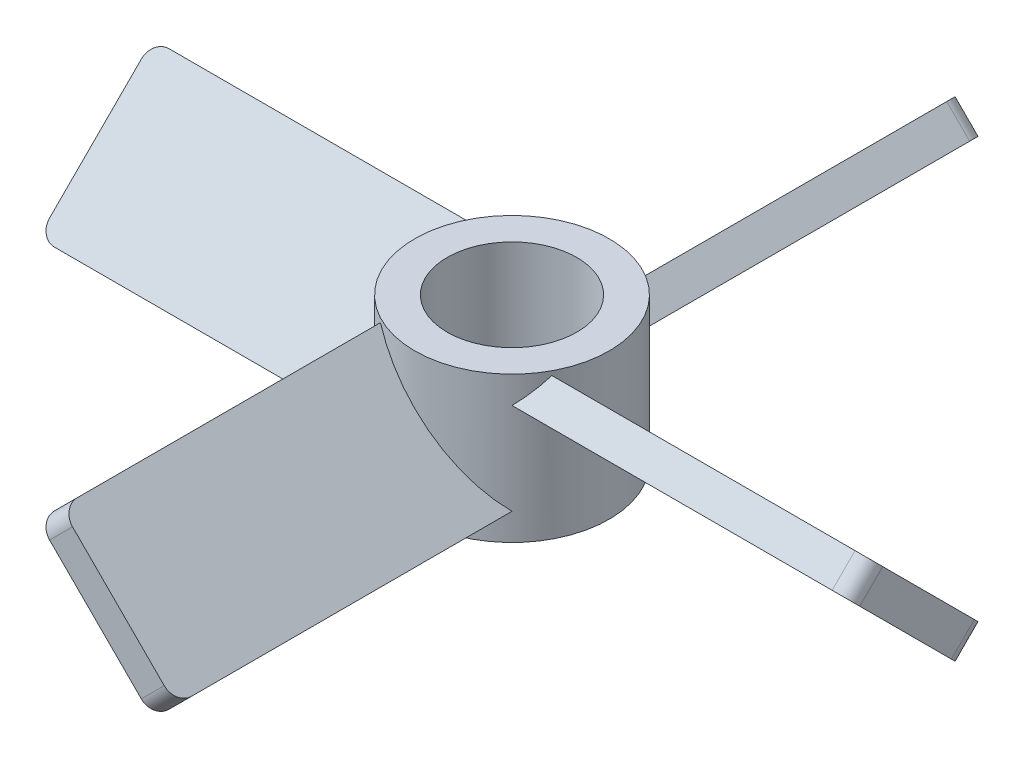
ISO-10303-21;
HEADER;
FILE_DESCRIPTION(('STEP AP214'),'2;1');
FILE_NAME('part.step','',(''),(''),'','','');
FILE_SCHEMA(('AUTOMOTIVE_DESIGN { 1 0 10303 214 1 1 1 1 }'));
ENDSEC;
DATA;
#1=APPLICATION_CONTEXT('core data for automotive mechanical design processes');
#2=APPLICATION_PROTOCOL_DEFINITION('international standard','automotive_design',2000,#1);
#3=PRODUCT_CONTEXT('',#1,'mechanical');
#4=PRODUCT('Part','Part','',(#3));
#5=PRODUCT_RELATED_PRODUCT_CATEGORY('part','',(#4));
#6=PRODUCT_DEFINITION_FORMATION('','',#4);
#7=PRODUCT_DEFINITION_CONTEXT('part definition',#1,'design');
#8=PRODUCT_DEFINITION('design','',#6,#7);
#9=PRODUCT_DEFINITION_SHAPE('','',#8);
#10=(LENGTH_UNIT() NAMED_UNIT(*) SI_UNIT(.MILLI.,.METRE.));
#11=(NAMED_UNIT(*) PLANE_ANGLE_UNIT() SI_UNIT($,.RADIAN.));
#12=(NAMED_UNIT(*) SI_UNIT($,.STERADIAN.) SOLID_ANGLE_UNIT());
#13=UNCERTAINTY_MEASURE_WITH_UNIT(LENGTH_MEASURE(1.E-05),#10,'distance_accuracy_value','');
#14=(GEOMETRIC_REPRESENTATION_CONTEXT(3) GLOBAL_UNCERTAINTY_ASSIGNED_CONTEXT((#13)) GLOBAL_UNIT_ASSIGNED_CONTEXT((#10,
#11,#12)) REPRESENTATION_CONTEXT('',''));
#15=CARTESIAN_POINT('',(0.,0.,0.));
#16=DIRECTION('',(0.,0.,1.));
#17=DIRECTION('',(1.,0.,0.));
#18=AXIS2_PLACEMENT_3D('',#15,#16,#17);
#19=CARTESIAN_POINT('',(-4.,4.5,0.));
#20=DIRECTION('',(0.,-1.,0.));
#21=DIRECTION('',(0.,0.,-1.));
#22=AXIS2_PLACEMENT_3D('',#19,#20,#21);
#23=CYLINDRICAL_SURFACE('',#22,6.);
#24=CARTESIAN_POINT('',(-4.,-7.07106781186544,0.));
#25=DIRECTION('',(0.,0.707106781186549,-0.707106781186546));
#26=DIRECTION('',(0.,-0.707106781186546,-0.707106781186549));
#27=AXIS2_PLACEMENT_3D('',#24,#25,#26);
#28=ELLIPSE('',#27,8.48528137423856,6.);
#29=CARTESIAN_POINT('',(-8.24264068711935,-2.82842712474624,4.24264068711922));
#30=VERTEX_POINT('',#29);
#31=CARTESIAN_POINT('',(-9.29150262212917,-4.24264068711925,2.82842712474624));
#32=VERTEX_POINT('',#31);
#33=EDGE_CURVE('E575',#30,#32,#28,.F.);
#34=ORIENTED_EDGE('',*,*,#33,.T.);
#35=CARTESIAN_POINT('',(-4.,-1.41421356237297,0.));
#36=DIRECTION('',(0.,0.707106781186546,0.707106781186549));
#37=DIRECTION('',(0.,-0.707106781186549,0.707106781186546));
#38=AXIS2_PLACEMENT_3D('',#35,#36,#37);
#39=ELLIPSE('',#38,8.48528137423859,6.);
#40=CARTESIAN_POINT('',(-8.24264068711932,2.82842712474627,-4.24264068711925));
#41=VERTEX_POINT('',#40);
#42=EDGE_CURVE('E214',#32,#41,#39,.F.);
#43=ORIENTED_EDGE('',*,*,#42,.T.);
#44=CARTESIAN_POINT('',(-4.,7.07106781186544,0.));
#45=DIRECTION('',(0.,-0.707106781186549,0.707106781186546));
#46=DIRECTION('',(0.,-0.707106781186546,-0.707106781186549));
#47=AXIS2_PLACEMENT_3D('',#44,#45,#46);
#48=ELLIPSE('',#47,8.48528137423856,6.);
#49=CARTESIAN_POINT('',(-9.29150262212917,4.24264068711923,-2.82842712474622));
#50=VERTEX_POINT('',#49);
#51=EDGE_CURVE('E773',#41,#50,#48,.F.);
#52=ORIENTED_EDGE('',*,*,#51,.T.);
#53=CARTESIAN_POINT('',(-4.,1.41421356237298,0.));
#54=DIRECTION('',(0.,-0.707106781186546,-0.707106781186549));
#55=DIRECTION('',(0.,-0.707106781186549,0.707106781186546));
#56=AXIS2_PLACEMENT_3D('',#53,#54,#55);
#57=ELLIPSE('',#56,8.48528137423859,6.);
#58=EDGE_CURVE('E780',#50,#30,#57,.F.);
#59=ORIENTED_EDGE('',*,*,#58,.T.);
#60=EDGE_LOOP('',(#34,#43,#52,#59));
#61=FACE_BOUND('',#60,.T.);
#62=CARTESIAN_POINT('',(-4.,-7.07106781186544,0.));
#63=DIRECTION('',(0.,0.707106781186549,0.707106781186546));
#64=DIRECTION('',(0.,-0.707106781186546,0.707106781186549));
#65=AXIS2_PLACEMENT_3D('',#62,#63,#64);
#66=ELLIPSE('',#65,8.48528137423856,6.);
#67=CARTESIAN_POINT('',(0.242640687119353,-2.82842712474614,-4.24264068711932));
#68=VERTEX_POINT('',#67);
#69=CARTESIAN_POINT('',(1.29150262212917,-4.24264068711925,-2.82842712474624));
#70=VERTEX_POINT('',#69);
#71=EDGE_CURVE('E480',#68,#70,#66,.F.);
#72=ORIENTED_EDGE('',*,*,#71,.T.);
#73=CARTESIAN_POINT('',(-4.,-1.41421356237297,0.));
#74=DIRECTION('',(0.,0.707106781186546,-0.707106781186549));
#75=DIRECTION('',(0.,-0.707106781186549,-0.707106781186546));
#76=AXIS2_PLACEMENT_3D('',#73,#74,#75);
#77=ELLIPSE('',#76,8.48528137423859,6.);
#78=CARTESIAN_POINT('',(0.242640687119252,2.82842712474614,4.24264068711932));
#79=VERTEX_POINT('',#78);
#80=EDGE_CURVE('E488',#70,#79,#77,.F.);
#81=ORIENTED_EDGE('',*,*,#80,.T.);
#82=CARTESIAN_POINT('',(-4.,7.07106781186544,0.));
#83=DIRECTION('',(0.,-0.707106781186549,-0.707106781186546));
#84=DIRECTION('',(0.,-0.707106781186546,0.707106781186549));
#85=AXIS2_PLACEMENT_3D('',#82,#83,#84);
#86=ELLIPSE('',#85,8.48528137423856,6.);
#87=CARTESIAN_POINT('',(1.29150262212916,4.24264068711925,2.82842712474624));
#88=VERTEX_POINT('',#87);
#89=EDGE_CURVE('E511',#79,#88,#86,.F.);
#90=ORIENTED_EDGE('',*,*,#89,.T.);
#91=CARTESIAN_POINT('',(-4.,1.41421356237298,0.));
#92=DIRECTION('',(0.,-0.707106781186546,0.707106781186549));
#93=DIRECTION('',(0.,-0.707106781186549,-0.707106781186546));
#94=AXIS2_PLACEMENT_3D('',#91,#92,#93);
#95=ELLIPSE('',#94,8.48528137423859,6.);
#96=EDGE_CURVE('E388',#88,#68,#95,.F.);
#97=ORIENTED_EDGE('',*,*,#96,.T.);
#98=EDGE_LOOP('',(#72,#81,#90,#97));
#99=FACE_BOUND('',#98,.T.);
#100=CARTESIAN_POINT('',(-4.,4.5,0.));
#101=DIRECTION('',(0.,1.,0.));
#102=DIRECTION('',(0.,0.,1.));
#103=AXIS2_PLACEMENT_3D('',#100,#101,#102);
#104=CIRCLE('',#103,6.);
#105=CARTESIAN_POINT('',(-4.,4.5,6.));
#106=VERTEX_POINT('',#105);
#107=EDGE_CURVE('E515',#106,#106,#104,.T.);
#108=ORIENTED_EDGE('',*,*,#107,.F.);
#109=EDGE_LOOP('',(#108));
#110=FACE_BOUND('',#109,.T.);
#111=CARTESIAN_POINT('',(-4.,-4.5,0.));
#112=DIRECTION('',(0.,1.,0.));
#113=DIRECTION('',(0.,0.,1.));
#114=AXIS2_PLACEMENT_3D('',#111,#112,#113);
#115=CIRCLE('',#114,6.);
#116=CARTESIAN_POINT('',(-4.,-4.5,6.));
#117=VERTEX_POINT('',#116);
#118=EDGE_CURVE('E516',#117,#117,#115,.T.);
#119=ORIENTED_EDGE('',*,*,#118,.T.);
#120=EDGE_LOOP('',(#119));
#121=FACE_BOUND('',#120,.T.);
#122=CARTESIAN_POINT('',(-4.,-7.07106781186544,0.));
#123=DIRECTION('',(0.707106781186546,0.707106781186549,0.));
#124=DIRECTION('',(0.707106781186549,-0.707106781186546,0.));
#125=AXIS2_PLACEMENT_3D('',#122,#123,#124);
#126=ELLIPSE('',#125,8.48528137423856,6.);
#127=CARTESIAN_POINT('',(-8.24264068711924,-2.82842712474624,-4.24264068711934));
#128=VERTEX_POINT('',#127);
#129=CARTESIAN_POINT('',(-6.82842712474626,-4.24264068711925,-5.29150262212916));
#130=VERTEX_POINT('',#129);
#131=EDGE_CURVE('E519',#128,#130,#126,.F.);
#132=ORIENTED_EDGE('',*,*,#131,.T.);
#133=CARTESIAN_POINT('',(-4.,-1.41421356237297,0.));
#134=DIRECTION('',(-0.707106781186549,0.707106781186546,0.));
#135=DIRECTION('',(-0.707106781186546,-0.707106781186549,0.));
#136=AXIS2_PLACEMENT_3D('',#133,#134,#135);
#137=ELLIPSE('',#136,8.48528137423859,6.);
#138=CARTESIAN_POINT('',(0.242640687119237,2.82842712474627,-4.24264068711933));
#139=VERTEX_POINT('',#138);
#140=EDGE_CURVE('E574',#130,#139,#137,.F.);
#141=ORIENTED_EDGE('',*,*,#140,.T.);
#142=CARTESIAN_POINT('',(-4.,7.07106781186544,0.));
#143=DIRECTION('',(-0.707106781186546,-0.707106781186549,0.));
#144=DIRECTION('',(0.707106781186549,-0.707106781186546,0.));
#145=AXIS2_PLACEMENT_3D('',#142,#143,#144);
#146=ELLIPSE('',#145,8.48528137423856,6.);
#147=CARTESIAN_POINT('',(-1.1715728752538,4.24264068711923,-5.29150262212917));
#148=VERTEX_POINT('',#147);
#149=EDGE_CURVE('E549',#139,#148,#146,.F.);
#150=ORIENTED_EDGE('',*,*,#149,.T.);
#151=CARTESIAN_POINT('',(-4.,1.41421356237298,0.));
#152=DIRECTION('',(0.707106781186549,-0.707106781186546,0.));
#153=DIRECTION('',(-0.707106781186546,-0.707106781186549,0.));
#154=AXIS2_PLACEMENT_3D('',#151,#152,#153);
#155=ELLIPSE('',#154,8.48528137423859,6.);
#156=EDGE_CURVE('E530',#148,#128,#155,.F.);
#157=ORIENTED_EDGE('',*,*,#156,.T.);
#158=EDGE_LOOP('',(#132,#141,#150,#157));
#159=FACE_BOUND('',#158,.T.);
#160=CARTESIAN_POINT('',(-4.,-7.07106781186544,0.));
#161=DIRECTION('',(-0.707106781186546,0.707106781186549,0.));
#162=DIRECTION('',(-0.707106781186549,-0.707106781186546,0.));
#163=AXIS2_PLACEMENT_3D('',#160,#161,#162);
#164=ELLIPSE('',#163,8.48528137423856,6.);
#165=CARTESIAN_POINT('',(0.242640687119264,-2.82842712474624,4.24264068711931));
#166=VERTEX_POINT('',#165);
#167=CARTESIAN_POINT('',(-1.1715728752537,-4.24264068711925,5.29150262212914));
#168=VERTEX_POINT('',#167);
#169=EDGE_CURVE('E208',#166,#168,#164,.F.);
#170=ORIENTED_EDGE('',*,*,#169,.T.);
#171=CARTESIAN_POINT('',(-4.,-1.41421356237297,0.));
#172=DIRECTION('',(0.707106781186549,0.707106781186546,0.));
#173=DIRECTION('',(0.707106781186546,-0.707106781186549,0.));
#174=AXIS2_PLACEMENT_3D('',#171,#172,#173);
#175=ELLIPSE('',#174,8.48528137423859,6.);
#176=CARTESIAN_POINT('',(-8.24264068711921,2.82842712474627,4.24264068711937));
#177=VERTEX_POINT('',#176);
#178=EDGE_CURVE('E210',#168,#177,#175,.F.);
#179=ORIENTED_EDGE('',*,*,#178,.T.);
#180=CARTESIAN_POINT('',(-4.,7.07106781186544,0.));
#181=DIRECTION('',(0.707106781186546,-0.707106781186549,0.));
#182=DIRECTION('',(-0.707106781186549,-0.707106781186546,0.));
#183=AXIS2_PLACEMENT_3D('',#180,#181,#182);
#184=ELLIPSE('',#183,8.48528137423856,6.);
#185=CARTESIAN_POINT('',(-6.82842712474617,4.24264068711923,5.2915026221292));
#186=VERTEX_POINT('',#185);
#187=EDGE_CURVE('E936',#177,#186,#184,.F.);
#188=ORIENTED_EDGE('',*,*,#187,.T.);
#189=CARTESIAN_POINT('',(-4.,1.41421356237298,0.));
#190=DIRECTION('',(-0.707106781186549,-0.707106781186546,0.));
#191=DIRECTION('',(0.707106781186546,-0.707106781186549,0.));
#192=AXIS2_PLACEMENT_3D('',#189,#190,#191);
#193=ELLIPSE('',#192,8.48528137423859,6.);
#194=EDGE_CURVE('E212',#186,#166,#193,.F.);
#195=ORIENTED_EDGE('',*,*,#194,.T.);
#196=EDGE_LOOP('',(#170,#179,#188,#195));
#197=FACE_BOUND('',#196,.T.);
#198=ADVANCED_FACE('F43',(#61,#99,#110,#121,#159,#197),#23,.T.);
#199=CARTESIAN_POINT('',(0.,-0.707106781186496,0.707106781186498));
#200=DIRECTION('',(0.,0.707106781186546,-0.707106781186549));
#201=DIRECTION('',(0.,0.707106781186549,0.707106781186546));
#202=AXIS2_PLACEMENT_3D('',#199,#200,#201);
#203=PLANE('',#202);
#204=DIRECTION('',(1.,0.,0.));
#205=VECTOR('',#204,1.);
#206=CARTESIAN_POINT('',(0.,-4.24264068711925,-2.82842712474624));
#207=LINE('',#206,#205);
#208=CARTESIAN_POINT('',(20.,-4.24264068711929,-2.82842712474618));
#209=VERTEX_POINT('',#208);
#210=EDGE_CURVE('E482',#70,#209,#207,.T.);
#211=ORIENTED_EDGE('',*,*,#210,.T.);
#212=CARTESIAN_POINT('',(20.,-3.53553390593274,-2.12132034355964));
#213=DIRECTION('',(0.,0.707106781186546,-0.707106781186549));
#214=DIRECTION('',(0.,0.707106781186549,0.707106781186546));
#215=AXIS2_PLACEMENT_3D('',#212,#213,#214);
#216=CIRCLE('',#215,1.);
#217=CARTESIAN_POINT('',(21.,-3.53553390593274,-2.12132034355963));
#218=VERTEX_POINT('',#217);
#219=EDGE_CURVE('E317',#209,#218,#216,.F.);
#220=ORIENTED_EDGE('',*,*,#219,.T.);
#221=DIRECTION('',(0.,-0.707106781186549,-0.707106781186546));
#222=VECTOR('',#221,1.);
#223=CARTESIAN_POINT('',(21.,-4.24264068711929,-2.82842712474618));
#224=LINE('',#223,#222);
#225=CARTESIAN_POINT('',(21.,2.12132034355965,3.53553390593274));
#226=VERTEX_POINT('',#225);
#227=EDGE_CURVE('E241',#226,#218,#224,.T.);
#228=ORIENTED_EDGE('',*,*,#227,.F.);
#229=CARTESIAN_POINT('',(20.,2.12132034355965,3.53553390593273));
#230=DIRECTION('',(0.,0.707106781186546,-0.707106781186549));
#231=DIRECTION('',(0.,0.707106781186549,0.707106781186546));
#232=AXIS2_PLACEMENT_3D('',#229,#230,#231);
#233=CIRCLE('',#232,1.);
#234=CARTESIAN_POINT('',(20.,2.8284271247462,4.24264068711928));
#235=VERTEX_POINT('',#234);
#236=EDGE_CURVE('E315',#226,#235,#233,.F.);
#237=ORIENTED_EDGE('',*,*,#236,.T.);
#238=DIRECTION('',(1.,0.,0.));
#239=VECTOR('',#238,1.);
#240=CARTESIAN_POINT('',(0.,2.82842712474613,4.24264068711932));
#241=LINE('',#240,#239);
#242=EDGE_CURVE('E489',#79,#235,#241,.T.);
#243=ORIENTED_EDGE('',*,*,#242,.F.);
#244=ORIENTED_EDGE('',*,*,#80,.F.);
#245=EDGE_LOOP('',(#211,#220,#228,#237,#243,#244));
#246=FACE_BOUND('',#245,.T.);
#247=ADVANCED_FACE('F458',(#246),#203,.F.);
#248=CARTESIAN_POINT('',(0.,3.53553390593273,3.53553390593272));
#249=DIRECTION('',(0.,-0.707106781186549,-0.707106781186546));
#250=DIRECTION('',(0.,0.707106781186546,-0.707106781186549));
#251=AXIS2_PLACEMENT_3D('',#248,#249,#250);
#252=PLANE('',#251);
#253=ORIENTED_EDGE('',*,*,#242,.T.);
#254=DIRECTION('',(0.,-0.707106781186546,0.707106781186549));
#255=VECTOR('',#254,1.);
#256=CARTESIAN_POINT('',(20.,3.53553390593275,3.53553390593273));
#257=LINE('',#256,#255);
#258=CARTESIAN_POINT('',(20.,4.24264068711929,2.82842712474619));
#259=VERTEX_POINT('',#258);
#260=EDGE_CURVE('E321',#235,#259,#257,.F.);
#261=ORIENTED_EDGE('',*,*,#260,.T.);
#262=DIRECTION('',(1.,0.,0.));
#263=VECTOR('',#262,1.);
#264=CARTESIAN_POINT('',(0.,4.24264068711925,2.82842712474624));
#265=LINE('',#264,#263);
#266=EDGE_CURVE('E240',#88,#259,#265,.T.);
#267=ORIENTED_EDGE('',*,*,#266,.F.);
#268=ORIENTED_EDGE('',*,*,#89,.F.);
#269=EDGE_LOOP('',(#253,#261,#267,#268));
#270=FACE_BOUND('',#269,.T.);
#271=ADVANCED_FACE('F463',(#270),#252,.F.);
#272=CARTESIAN_POINT('',(0.,-3.53553390593273,-3.53553390593272));
#273=DIRECTION('',(0.,0.707106781186549,0.707106781186546));
#274=DIRECTION('',(0.,-0.707106781186546,0.707106781186549));
#275=AXIS2_PLACEMENT_3D('',#272,#273,#274);
#276=PLANE('',#275);
#277=DIRECTION('',(1.,0.,0.));
#278=VECTOR('',#277,1.);
#279=CARTESIAN_POINT('',(0.,-2.82842712474614,-4.24264068711932));
#280=LINE('',#279,#278);
#281=CARTESIAN_POINT('',(20.,-2.82842712474619,-4.24264068711928));
#282=VERTEX_POINT('',#281);
#283=EDGE_CURVE('E475',#68,#282,#280,.T.);
#284=ORIENTED_EDGE('',*,*,#283,.T.);
#285=DIRECTION('',(0.,0.707106781186546,-0.707106781186549));
#286=VECTOR('',#285,1.);
#287=CARTESIAN_POINT('',(20.,-3.53553390593274,-3.53553390593273));
#288=LINE('',#287,#286);
#289=EDGE_CURVE('E311',#282,#209,#288,.F.);
#290=ORIENTED_EDGE('',*,*,#289,.T.);
#291=ORIENTED_EDGE('',*,*,#210,.F.);
#292=ORIENTED_EDGE('',*,*,#71,.F.);
#293=EDGE_LOOP('',(#284,#290,#291,#292));
#294=FACE_BOUND('',#293,.T.);
#295=ADVANCED_FACE('F465',(#294),#276,.F.);
#296=CARTESIAN_POINT('',(0.,0.707106781186495,-0.707106781186497));
#297=DIRECTION('',(0.,-0.707106781186546,0.707106781186549));
#298=DIRECTION('',(0.,-0.707106781186549,-0.707106781186546));
#299=AXIS2_PLACEMENT_3D('',#296,#297,#298);
#300=PLANE('',#299);
#301=DIRECTION('',(0.,0.707106781186549,0.707106781186546));
#302=VECTOR('',#301,1.);
#303=CARTESIAN_POINT('',(21.,-2.8284271247462,-4.24264068711928));
#304=LINE('',#303,#302);
#305=CARTESIAN_POINT('',(21.,-2.12132034355965,-3.53553390593273));
#306=VERTEX_POINT('',#305);
#307=CARTESIAN_POINT('',(21.,3.53553390593274,2.12132034355964));
#308=VERTEX_POINT('',#307);
#309=EDGE_CURVE('E236',#306,#308,#304,.T.);
#310=ORIENTED_EDGE('',*,*,#309,.F.);
#311=CARTESIAN_POINT('',(20.,-2.12132034355965,-3.53553390593273));
#312=DIRECTION('',(0.,-0.707106781186546,0.707106781186549));
#313=DIRECTION('',(0.,-0.707106781186549,-0.707106781186546));
#314=AXIS2_PLACEMENT_3D('',#311,#312,#313);
#315=CIRCLE('',#314,1.);
#316=EDGE_CURVE('E307',#306,#282,#315,.F.);
#317=ORIENTED_EDGE('',*,*,#316,.T.);
#318=ORIENTED_EDGE('',*,*,#283,.F.);
#319=ORIENTED_EDGE('',*,*,#96,.F.);
#320=ORIENTED_EDGE('',*,*,#266,.T.);
#321=CARTESIAN_POINT('',(20.,3.53553390593274,2.12132034355964));
#322=DIRECTION('',(0.,-0.707106781186546,0.707106781186549));
#323=DIRECTION('',(0.,-0.707106781186549,-0.707106781186546));
#324=AXIS2_PLACEMENT_3D('',#321,#322,#323);
#325=CIRCLE('',#324,1.);
#326=EDGE_CURVE('E303',#259,#308,#325,.F.);
#327=ORIENTED_EDGE('',*,*,#326,.T.);
#328=EDGE_LOOP('',(#310,#317,#318,#319,#320,#327));
#329=FACE_BOUND('',#328,.T.);
#330=ADVANCED_FACE('F268',(#329),#300,.F.);
#331=CARTESIAN_POINT('',(21.,0.,0.));
#332=DIRECTION('',(-1.,0.,0.));
#333=DIRECTION('',(0.,0.,1.));
#334=AXIS2_PLACEMENT_3D('',#331,#332,#333);
#335=PLANE('',#334);
#336=ORIENTED_EDGE('',*,*,#227,.T.);
#337=DIRECTION('',(0.,0.707106781186546,-0.707106781186549));
#338=VECTOR('',#337,1.);
#339=CARTESIAN_POINT('',(21.,-2.82842712474619,-2.82842712474618));
#340=LINE('',#339,#338);
#341=EDGE_CURVE('E298',#218,#306,#340,.T.);
#342=ORIENTED_EDGE('',*,*,#341,.T.);
#343=ORIENTED_EDGE('',*,*,#309,.T.);
#344=DIRECTION('',(0.,-0.707106781186546,0.707106781186549));
#345=VECTOR('',#344,1.);
#346=CARTESIAN_POINT('',(21.,2.8284271247462,2.82842712474619));
#347=LINE('',#346,#345);
#348=EDGE_CURVE('E296',#308,#226,#347,.T.);
#349=ORIENTED_EDGE('',*,*,#348,.T.);
#350=EDGE_LOOP('',(#336,#342,#343,#349));
#351=FACE_BOUND('',#350,.T.);
#352=ADVANCED_FACE('F257',(#351),#335,.F.);
#353=CARTESIAN_POINT('',(-4.,4.5,0.));
#354=DIRECTION('',(0.,1.,0.));
#355=DIRECTION('',(0.,0.,1.));
#356=AXIS2_PLACEMENT_3D('',#353,#354,#355);
#357=PLANE('',#356);
#358=CARTESIAN_POINT('',(-4.,4.5,0.));
#359=DIRECTION('',(0.,1.,0.));
#360=DIRECTION('',(0.,0.,1.));
#361=AXIS2_PLACEMENT_3D('',#358,#359,#360);
#362=CIRCLE('',#361,4.);
#363=CARTESIAN_POINT('',(-4.,4.5,4.));
#364=VERTEX_POINT('',#363);
#365=EDGE_CURVE('E940',#364,#364,#362,.T.);
#366=ORIENTED_EDGE('',*,*,#365,.F.);
#367=EDGE_LOOP('',(#366));
#368=FACE_BOUND('',#367,.T.);
#369=ORIENTED_EDGE('',*,*,#107,.T.);
#370=EDGE_LOOP('',(#369));
#371=FACE_BOUND('',#370,.T.);
#372=ADVANCED_FACE('F267',(#368,#371),#357,.T.);
#373=CARTESIAN_POINT('',(-4.,-4.5,0.));
#374=DIRECTION('',(0.,1.,0.));
#375=DIRECTION('',(0.,0.,1.));
#376=AXIS2_PLACEMENT_3D('',#373,#374,#375);
#377=PLANE('',#376);
#378=CARTESIAN_POINT('',(-4.,-4.5,0.));
#379=DIRECTION('',(0.,1.,0.));
#380=DIRECTION('',(0.,0.,1.));
#381=AXIS2_PLACEMENT_3D('',#378,#379,#380);
#382=CIRCLE('',#381,4.);
#383=CARTESIAN_POINT('',(-4.,-4.5,4.));
#384=VERTEX_POINT('',#383);
#385=EDGE_CURVE('E222',#384,#384,#382,.F.);
#386=ORIENTED_EDGE('',*,*,#385,.F.);
#387=EDGE_LOOP('',(#386));
#388=FACE_BOUND('',#387,.T.);
#389=ORIENTED_EDGE('',*,*,#118,.F.);
#390=EDGE_LOOP('',(#389));
#391=FACE_BOUND('',#390,.T.);
#392=ADVANCED_FACE('F449',(#388,#391),#377,.F.);
#393=CARTESIAN_POINT('',(-4.00000000000009,0.,-25.));
#394=DIRECTION('',(0.,0.,1.));
#395=DIRECTION('',(1.,0.,0.));
#396=AXIS2_PLACEMENT_3D('',#393,#394,#395);
#397=PLANE('',#396);
#398=DIRECTION('',(-0.707106781186546,-0.707106781186549,0.));
#399=VECTOR('',#398,1.);
#400=CARTESIAN_POINT('',(-6.82842712474627,-4.24264068711929,-25.));
#401=LINE('',#400,#399);
#402=CARTESIAN_POINT('',(-0.464466094067353,2.12132034355965,-25.));
#403=VERTEX_POINT('',#402);
#404=CARTESIAN_POINT('',(-6.12132034355972,-3.53553390593274,-25.));
#405=VERTEX_POINT('',#404);
#406=EDGE_CURVE('E533',#403,#405,#401,.T.);
#407=ORIENTED_EDGE('',*,*,#406,.T.);
#408=DIRECTION('',(-0.707106781186549,0.707106781186546,0.));
#409=VECTOR('',#408,1.);
#410=CARTESIAN_POINT('',(-6.82842712474627,-2.82842712474619,-25.));
#411=LINE('',#410,#409);
#412=CARTESIAN_POINT('',(-7.53553390593282,-2.12132034355965,-25.));
#413=VERTEX_POINT('',#412);
#414=EDGE_CURVE('E982',#405,#413,#411,.T.);
#415=ORIENTED_EDGE('',*,*,#414,.T.);
#416=DIRECTION('',(0.707106781186546,0.707106781186549,0.));
#417=VECTOR('',#416,1.);
#418=CARTESIAN_POINT('',(-8.24264068711937,-2.8284271247462,-25.));
#419=LINE('',#418,#417);
#420=CARTESIAN_POINT('',(-1.87867965644045,3.53553390593274,-25.));
#421=VERTEX_POINT('',#420);
#422=EDGE_CURVE('E423',#413,#421,#419,.T.);
#423=ORIENTED_EDGE('',*,*,#422,.T.);
#424=DIRECTION('',(0.707106781186549,-0.707106781186546,0.));
#425=VECTOR('',#424,1.);
#426=CARTESIAN_POINT('',(-1.1715728752539,2.8284271247462,-25.));
#427=LINE('',#426,#425);
#428=EDGE_CURVE('E415',#421,#403,#427,.T.);
#429=ORIENTED_EDGE('',*,*,#428,.T.);
#430=EDGE_LOOP('',(#407,#415,#423,#429));
#431=FACE_BOUND('',#430,.T.);
#432=ADVANCED_FACE('F438',(#431),#397,.F.);
#433=CARTESIAN_POINT('',(-7.53553390593274,-3.53553390593273,-3.99999999999998));
#434=DIRECTION('',(0.707106781186546,0.707106781186549,0.));
#435=DIRECTION('',(0.707106781186549,-0.707106781186546,0.));
#436=AXIS2_PLACEMENT_3D('',#433,#434,#435);
#437=PLANE('',#436);
#438=DIRECTION('',(0.,0.,-1.));
#439=VECTOR('',#438,1.);
#440=CARTESIAN_POINT('',(-8.24264068711934,-2.82842712474614,-3.99999999999998));
#441=LINE('',#440,#439);
#442=CARTESIAN_POINT('',(-8.24264068711937,-2.82842712474619,-24.));
#443=VERTEX_POINT('',#442);
#444=EDGE_CURVE('E523',#128,#443,#441,.T.);
#445=ORIENTED_EDGE('',*,*,#444,.T.);
#446=DIRECTION('',(-0.707106781186549,0.707106781186546,0.));
#447=VECTOR('',#446,1.);
#448=CARTESIAN_POINT('',(-7.53553390593281,-3.53553390593274,-24.));
#449=LINE('',#448,#447);
#450=CARTESIAN_POINT('',(-6.82842712474627,-4.24264068711929,-24.));
#451=VERTEX_POINT('',#450);
#452=EDGE_CURVE('E571',#443,#451,#449,.F.);
#453=ORIENTED_EDGE('',*,*,#452,.T.);
#454=DIRECTION('',(0.,0.,-1.));
#455=VECTOR('',#454,1.);
#456=CARTESIAN_POINT('',(-6.82842712474626,-4.24264068711925,-3.99999999999999));
#457=LINE('',#456,#455);
#458=EDGE_CURVE('E538',#130,#451,#457,.T.);
#459=ORIENTED_EDGE('',*,*,#458,.F.);
#460=ORIENTED_EDGE('',*,*,#131,.F.);
#461=EDGE_LOOP('',(#445,#453,#459,#460));
#462=FACE_BOUND('',#461,.T.);
#463=ADVANCED_FACE('F448',(#462),#437,.F.);
#464=CARTESIAN_POINT('',(-4.70710678118651,0.707106781186495,-3.99999999999999));
#465=DIRECTION('',(0.707106781186549,-0.707106781186546,0.));
#466=DIRECTION('',(-0.707106781186546,-0.707106781186549,0.));
#467=AXIS2_PLACEMENT_3D('',#464,#465,#466);
#468=PLANE('',#467);
#469=ORIENTED_EDGE('',*,*,#422,.F.);
#470=CARTESIAN_POINT('',(-7.53553390593282,-2.12132034355965,-24.));
#471=DIRECTION('',(0.707106781186549,-0.707106781186546,0.));
#472=DIRECTION('',(0.707106781186546,0.707106781186549,0.));
#473=AXIS2_PLACEMENT_3D('',#470,#471,#472);
#474=CIRCLE('',#473,1.);
#475=EDGE_CURVE('E566',#413,#443,#474,.F.);
#476=ORIENTED_EDGE('',*,*,#475,.T.);
#477=ORIENTED_EDGE('',*,*,#444,.F.);
#478=ORIENTED_EDGE('',*,*,#156,.F.);
#479=DIRECTION('',(0.,0.,-1.));
#480=VECTOR('',#479,1.);
#481=CARTESIAN_POINT('',(-1.17157287525377,4.24264068711925,-4.00000000000001));
#482=LINE('',#481,#480);
#483=CARTESIAN_POINT('',(-1.1715728752539,4.24264068711929,-24.));
#484=VERTEX_POINT('',#483);
#485=EDGE_CURVE('E553',#148,#484,#482,.T.);
#486=ORIENTED_EDGE('',*,*,#485,.T.);
#487=CARTESIAN_POINT('',(-1.87867965644044,3.53553390593274,-24.));
#488=DIRECTION('',(0.707106781186549,-0.707106781186546,0.));
#489=DIRECTION('',(0.707106781186546,0.707106781186549,0.));
#490=AXIS2_PLACEMENT_3D('',#487,#488,#489);
#491=CIRCLE('',#490,1.);
#492=EDGE_CURVE('E978',#484,#421,#491,.F.);
#493=ORIENTED_EDGE('',*,*,#492,.T.);
#494=EDGE_LOOP('',(#469,#476,#477,#478,#486,#493));
#495=FACE_BOUND('',#494,.T.);
#496=ADVANCED_FACE('F565',(#495),#468,.F.);
#497=CARTESIAN_POINT('',(-0.464466094067293,3.53553390593273,-4.00000000000001));
#498=DIRECTION('',(-0.707106781186546,-0.707106781186549,0.));
#499=DIRECTION('',(-0.707106781186549,0.707106781186546,0.));
#500=AXIS2_PLACEMENT_3D('',#497,#498,#499);
#501=PLANE('',#500);
#502=DIRECTION('',(0.,0.,-1.));
#503=VECTOR('',#502,1.);
#504=CARTESIAN_POINT('',(0.242640687119306,2.82842712474613,-4.00000000000001));
#505=LINE('',#504,#503);
#506=CARTESIAN_POINT('',(0.242640687119199,2.8284271247462,-24.));
#507=VERTEX_POINT('',#506);
#508=EDGE_CURVE('E537',#139,#507,#505,.T.);
#509=ORIENTED_EDGE('',*,*,#508,.T.);
#510=DIRECTION('',(0.707106781186549,-0.707106781186546,0.));
#511=VECTOR('',#510,1.);
#512=CARTESIAN_POINT('',(-0.464466094067351,3.53553390593275,-24.));
#513=LINE('',#512,#511);
#514=EDGE_CURVE('E299',#507,#484,#513,.F.);
#515=ORIENTED_EDGE('',*,*,#514,.T.);
#516=ORIENTED_EDGE('',*,*,#485,.F.);
#517=ORIENTED_EDGE('',*,*,#149,.F.);
#518=EDGE_LOOP('',(#509,#515,#516,#517));
#519=FACE_BOUND('',#518,.T.);
#520=ADVANCED_FACE('F600',(#519),#501,.F.);
#521=CARTESIAN_POINT('',(-3.29289321881352,-0.707106781186496,-4.));
#522=DIRECTION('',(-0.707106781186549,0.707106781186546,0.));
#523=DIRECTION('',(0.707106781186546,0.707106781186549,0.));
#524=AXIS2_PLACEMENT_3D('',#521,#522,#523);
#525=PLANE('',#524);
#526=ORIENTED_EDGE('',*,*,#458,.T.);
#527=CARTESIAN_POINT('',(-6.12132034355972,-3.53553390593274,-24.));
#528=DIRECTION('',(-0.707106781186549,0.707106781186546,0.));
#529=DIRECTION('',(-0.707106781186546,-0.707106781186549,0.));
#530=AXIS2_PLACEMENT_3D('',#527,#528,#529);
#531=CIRCLE('',#530,1.);
#532=EDGE_CURVE('E966',#451,#405,#531,.F.);
#533=ORIENTED_EDGE('',*,*,#532,.T.);
#534=ORIENTED_EDGE('',*,*,#406,.F.);
#535=CARTESIAN_POINT('',(-0.464466094067352,2.12132034355965,-24.));
#536=DIRECTION('',(-0.707106781186549,0.707106781186546,0.));
#537=DIRECTION('',(-0.707106781186546,-0.707106781186549,0.));
#538=AXIS2_PLACEMENT_3D('',#535,#536,#537);
#539=CIRCLE('',#538,1.);
#540=EDGE_CURVE('E970',#403,#507,#539,.F.);
#541=ORIENTED_EDGE('',*,*,#540,.T.);
#542=ORIENTED_EDGE('',*,*,#508,.F.);
#543=ORIENTED_EDGE('',*,*,#140,.F.);
#544=EDGE_LOOP('',(#526,#533,#534,#541,#542,#543));
#545=FACE_BOUND('',#544,.T.);
#546=ADVANCED_FACE('F589',(#545),#525,.F.);
#547=CARTESIAN_POINT('',(-29.,0.,0.));
#548=DIRECTION('',(1.,0.,0.));
#549=DIRECTION('',(0.,0.,-1.));
#550=AXIS2_PLACEMENT_3D('',#547,#548,#549);
#551=PLANE('',#550);
#552=DIRECTION('',(0.,-0.707106781186549,0.707106781186546));
#553=VECTOR('',#552,1.);
#554=CARTESIAN_POINT('',(-29.,-4.24264068711929,2.82842712474618));
#555=LINE('',#554,#553);
#556=CARTESIAN_POINT('',(-29.,2.12132034355965,-3.53553390593273));
#557=VERTEX_POINT('',#556);
#558=CARTESIAN_POINT('',(-29.,-3.53553390593274,2.12132034355964));
#559=VERTEX_POINT('',#558);
#560=EDGE_CURVE('E381',#557,#559,#555,.T.);
#561=ORIENTED_EDGE('',*,*,#560,.T.);
#562=DIRECTION('',(0.,0.707106781186546,0.707106781186549));
#563=VECTOR('',#562,1.);
#564=CARTESIAN_POINT('',(-29.,-2.82842712474619,2.82842712474619));
#565=LINE('',#564,#563);
#566=CARTESIAN_POINT('',(-29.,-2.12132034355965,3.53553390593273));
#567=VERTEX_POINT('',#566);
#568=EDGE_CURVE('E387',#559,#567,#565,.T.);
#569=ORIENTED_EDGE('',*,*,#568,.T.);
#570=DIRECTION('',(0.,0.707106781186549,-0.707106781186546));
#571=VECTOR('',#570,1.);
#572=CARTESIAN_POINT('',(-29.,-2.8284271247462,4.24264068711928));
#573=LINE('',#572,#571);
#574=CARTESIAN_POINT('',(-29.,3.53553390593274,-2.12132034355964));
#575=VERTEX_POINT('',#574);
#576=EDGE_CURVE('E539',#567,#575,#573,.T.);
#577=ORIENTED_EDGE('',*,*,#576,.T.);
#578=DIRECTION('',(0.,-0.707106781186546,-0.707106781186549));
#579=VECTOR('',#578,1.);
#580=CARTESIAN_POINT('',(-29.,2.8284271247462,-2.82842712474618));
#581=LINE('',#580,#579);
#582=EDGE_CURVE('E384',#575,#557,#581,.T.);
#583=ORIENTED_EDGE('',*,*,#582,.T.);
#584=EDGE_LOOP('',(#561,#569,#577,#583));
#585=FACE_BOUND('',#584,.T.);
#586=ADVANCED_FACE('F599',(#585),#551,.F.);
#587=CARTESIAN_POINT('',(-8.,-3.53553390593273,3.53553390593272));
#588=DIRECTION('',(0.,0.707106781186549,-0.707106781186546));
#589=DIRECTION('',(0.,-0.707106781186546,-0.707106781186549));
#590=AXIS2_PLACEMENT_3D('',#587,#588,#589);
#591=PLANE('',#590);
#592=DIRECTION('',(-1.,0.,0.));
#593=VECTOR('',#592,1.);
#594=CARTESIAN_POINT('',(-8.,-2.82842712474614,4.24264068711932));
#595=LINE('',#594,#593);
#596=CARTESIAN_POINT('',(-28.,-2.82842712474619,4.24264068711928));
#597=VERTEX_POINT('',#596);
#598=EDGE_CURVE('E577',#30,#597,#595,.T.);
#599=ORIENTED_EDGE('',*,*,#598,.T.);
#600=DIRECTION('',(0.,0.707106781186546,0.707106781186549));
#601=VECTOR('',#600,1.);
#602=CARTESIAN_POINT('',(-28.,-3.53553390593274,3.53553390593273));
#603=LINE('',#602,#601);
#604=CARTESIAN_POINT('',(-28.,-4.24264068711929,2.82842712474619));
#605=VERTEX_POINT('',#604);
#606=EDGE_CURVE('E401',#597,#605,#603,.F.);
#607=ORIENTED_EDGE('',*,*,#606,.T.);
#608=DIRECTION('',(-1.,0.,0.));
#609=VECTOR('',#608,1.);
#610=CARTESIAN_POINT('',(-8.,-4.24264068711925,2.82842712474625));
#611=LINE('',#610,#609);
#612=EDGE_CURVE('E765',#32,#605,#611,.T.);
#613=ORIENTED_EDGE('',*,*,#612,.F.);
#614=ORIENTED_EDGE('',*,*,#33,.F.);
#615=EDGE_LOOP('',(#599,#607,#613,#614));
#616=FACE_BOUND('',#615,.T.);
#617=ADVANCED_FACE('F820',(#616),#591,.F.);
#618=CARTESIAN_POINT('',(-8.,0.707106781186495,0.707106781186501));
#619=DIRECTION('',(0.,-0.707106781186546,-0.707106781186549));
#620=DIRECTION('',(0.,-0.707106781186549,0.707106781186546));
#621=AXIS2_PLACEMENT_3D('',#618,#619,#620);
#622=PLANE('',#621);
#623=ORIENTED_EDGE('',*,*,#576,.F.);
#624=CARTESIAN_POINT('',(-28.,-2.12132034355965,3.53553390593273));
#625=DIRECTION('',(0.,-0.707106781186546,-0.707106781186549));
#626=DIRECTION('',(0.,0.707106781186549,-0.707106781186546));
#627=AXIS2_PLACEMENT_3D('',#624,#625,#626);
#628=CIRCLE('',#627,1.);
#629=EDGE_CURVE('E397',#567,#597,#628,.F.);
#630=ORIENTED_EDGE('',*,*,#629,.T.);
#631=ORIENTED_EDGE('',*,*,#598,.F.);
#632=ORIENTED_EDGE('',*,*,#58,.F.);
#633=DIRECTION('',(-1.,0.,0.));
#634=VECTOR('',#633,1.);
#635=CARTESIAN_POINT('',(-8.,4.24264068711925,-2.82842712474624));
#636=LINE('',#635,#634);
#637=CARTESIAN_POINT('',(-28.,4.24264068711929,-2.82842712474618));
#638=VERTEX_POINT('',#637);
#639=EDGE_CURVE('E777',#50,#638,#636,.T.);
#640=ORIENTED_EDGE('',*,*,#639,.T.);
#641=CARTESIAN_POINT('',(-28.,3.53553390593274,-2.12132034355964));
#642=DIRECTION('',(0.,-0.707106781186546,-0.707106781186549));
#643=DIRECTION('',(0.,0.707106781186549,-0.707106781186546));
#644=AXIS2_PLACEMENT_3D('',#641,#642,#643);
#645=CIRCLE('',#644,1.);
#646=EDGE_CURVE('E393',#638,#575,#645,.F.);
#647=ORIENTED_EDGE('',*,*,#646,.T.);
#648=EDGE_LOOP('',(#623,#630,#631,#632,#640,#647));
#649=FACE_BOUND('',#648,.T.);
#650=ADVANCED_FACE('F819',(#649),#622,.F.);
#651=CARTESIAN_POINT('',(-8.,3.53553390593273,-3.53553390593272));
#652=DIRECTION('',(0.,-0.707106781186549,0.707106781186546));
#653=DIRECTION('',(0.,0.707106781186546,0.707106781186549));
#654=AXIS2_PLACEMENT_3D('',#651,#652,#653);
#655=PLANE('',#654);
#656=DIRECTION('',(-1.,0.,0.));
#657=VECTOR('',#656,1.);
#658=CARTESIAN_POINT('',(-8.,2.82842712474613,-4.24264068711932));
#659=LINE('',#658,#657);
#660=CARTESIAN_POINT('',(-28.,2.8284271247462,-4.24264068711928));
#661=VERTEX_POINT('',#660);
#662=EDGE_CURVE('E764',#41,#661,#659,.T.);
#663=ORIENTED_EDGE('',*,*,#662,.T.);
#664=DIRECTION('',(0.,-0.707106781186546,-0.707106781186549));
#665=VECTOR('',#664,1.);
#666=CARTESIAN_POINT('',(-28.,3.53553390593275,-3.53553390593273));
#667=LINE('',#666,#665);
#668=EDGE_CURVE('E411',#661,#638,#667,.F.);
#669=ORIENTED_EDGE('',*,*,#668,.T.);
#670=ORIENTED_EDGE('',*,*,#639,.F.);
#671=ORIENTED_EDGE('',*,*,#51,.F.);
#672=EDGE_LOOP('',(#663,#669,#670,#671));
#673=FACE_BOUND('',#672,.T.);
#674=ADVANCED_FACE('F360',(#673),#655,.F.);
#675=CARTESIAN_POINT('',(-8.,-0.707106781186496,-0.707106781186495));
#676=DIRECTION('',(0.,0.707106781186546,0.707106781186549));
#677=DIRECTION('',(0.,0.707106781186549,-0.707106781186546));
#678=AXIS2_PLACEMENT_3D('',#675,#676,#677);
#679=PLANE('',#678);
#680=ORIENTED_EDGE('',*,*,#612,.T.);
#681=CARTESIAN_POINT('',(-28.,-3.53553390593274,2.12132034355964));
#682=DIRECTION('',(0.,0.707106781186546,0.707106781186549));
#683=DIRECTION('',(0.,-0.707106781186549,0.707106781186546));
#684=AXIS2_PLACEMENT_3D('',#681,#682,#683);
#685=CIRCLE('',#684,1.);
#686=EDGE_CURVE('E407',#605,#559,#685,.F.);
#687=ORIENTED_EDGE('',*,*,#686,.T.);
#688=ORIENTED_EDGE('',*,*,#560,.F.);
#689=CARTESIAN_POINT('',(-28.,2.12132034355965,-3.53553390593273));
#690=DIRECTION('',(0.,0.707106781186546,0.707106781186549));
#691=DIRECTION('',(0.,-0.707106781186549,0.707106781186546));
#692=AXIS2_PLACEMENT_3D('',#689,#690,#691);
#693=CIRCLE('',#692,1.);
#694=EDGE_CURVE('E405',#557,#661,#693,.F.);
#695=ORIENTED_EDGE('',*,*,#694,.T.);
#696=ORIENTED_EDGE('',*,*,#662,.F.);
#697=ORIENTED_EDGE('',*,*,#42,.F.);
#698=EDGE_LOOP('',(#680,#687,#688,#695,#696,#697));
#699=FACE_BOUND('',#698,.T.);
#700=ADVANCED_FACE('F355',(#699),#679,.F.);
#701=CARTESIAN_POINT('',(-3.99999999999974,0.,25.));
#702=DIRECTION('',(0.,0.,-1.));
#703=DIRECTION('',(-1.,0.,0.));
#704=AXIS2_PLACEMENT_3D('',#701,#702,#703);
#705=PLANE('',#704);
#706=DIRECTION('',(0.707106781186546,-0.707106781186549,0.));
#707=VECTOR('',#706,1.);
#708=CARTESIAN_POINT('',(-1.17157287525356,-4.24264068711929,25.));
#709=LINE('',#708,#707);
#710=CARTESIAN_POINT('',(-7.53553390593247,2.12132034355965,25.));
#711=VERTEX_POINT('',#710);
#712=CARTESIAN_POINT('',(-1.8786796564401,-3.53553390593274,25.));
#713=VERTEX_POINT('',#712);
#714=EDGE_CURVE('E225',#711,#713,#709,.T.);
#715=ORIENTED_EDGE('',*,*,#714,.T.);
#716=DIRECTION('',(0.707106781186549,0.707106781186546,0.));
#717=VECTOR('',#716,1.);
#718=CARTESIAN_POINT('',(-1.17157287525355,-2.82842712474619,25.));
#719=LINE('',#718,#717);
#720=CARTESIAN_POINT('',(-0.464466094067006,-2.12132034355965,25.));
#721=VERTEX_POINT('',#720);
#722=EDGE_CURVE('E746',#713,#721,#719,.T.);
#723=ORIENTED_EDGE('',*,*,#722,.T.);
#724=DIRECTION('',(-0.707106781186546,0.707106781186549,0.));
#725=VECTOR('',#724,1.);
#726=CARTESIAN_POINT('',(0.242640687119542,-2.8284271247462,25.));
#727=LINE('',#726,#725);
#728=CARTESIAN_POINT('',(-6.12132034355937,3.53553390593274,25.));
#729=VERTEX_POINT('',#728);
#730=EDGE_CURVE('E47',#721,#729,#727,.T.);
#731=ORIENTED_EDGE('',*,*,#730,.T.);
#732=DIRECTION('',(-0.707106781186549,-0.707106781186546,0.));
#733=VECTOR('',#732,1.);
#734=CARTESIAN_POINT('',(-6.82842712474593,2.8284271247462,25.));
#735=LINE('',#734,#733);
#736=EDGE_CURVE('E325',#729,#711,#735,.T.);
#737=ORIENTED_EDGE('',*,*,#736,.T.);
#738=EDGE_LOOP('',(#715,#723,#731,#737));
#739=FACE_BOUND('',#738,.T.);
#740=ADVANCED_FACE('F345',(#739),#705,.F.);
#741=CARTESIAN_POINT('',(-0.464466094067236,-3.53553390593273,3.99999999999996));
#742=DIRECTION('',(-0.707106781186546,0.707106781186549,0.));
#743=DIRECTION('',(-0.707106781186549,-0.707106781186546,0.));
#744=AXIS2_PLACEMENT_3D('',#741,#742,#743);
#745=PLANE('',#744);
#746=DIRECTION('',(0.,0.,1.));
#747=VECTOR('',#746,1.);
#748=CARTESIAN_POINT('',(0.242640687119364,-2.82842712474614,3.99999999999996));
#749=LINE('',#748,#747);
#750=CARTESIAN_POINT('',(0.242640687119533,-2.82842712474619,23.9999999999999));
#751=VERTEX_POINT('',#750);
#752=EDGE_CURVE('E215',#166,#751,#749,.T.);
#753=ORIENTED_EDGE('',*,*,#752,.T.);
#754=DIRECTION('',(0.707106781186549,0.707106781186546,0.));
#755=VECTOR('',#754,1.);
#756=CARTESIAN_POINT('',(-0.464466094067019,-3.53553390593274,24.));
#757=LINE('',#756,#755);
#758=CARTESIAN_POINT('',(-1.17157287525356,-4.24264068711929,24.));
#759=VERTEX_POINT('',#758);
#760=EDGE_CURVE('E69',#751,#759,#757,.F.);
#761=ORIENTED_EDGE('',*,*,#760,.T.);
#762=DIRECTION('',(0.,0.,1.));
#763=VECTOR('',#762,1.);
#764=CARTESIAN_POINT('',(-1.17157287525371,-4.24264068711925,3.99999999999997));
#765=LINE('',#764,#763);
#766=EDGE_CURVE('E218',#168,#759,#765,.T.);
#767=ORIENTED_EDGE('',*,*,#766,.F.);
#768=ORIENTED_EDGE('',*,*,#169,.F.);
#769=EDGE_LOOP('',(#753,#761,#767,#768));
#770=FACE_BOUND('',#769,.T.);
#771=ADVANCED_FACE('F224',(#770),#745,.F.);
#772=CARTESIAN_POINT('',(-3.29289321881346,0.707106781186495,3.99999999999999));
#773=DIRECTION('',(-0.707106781186549,-0.707106781186546,0.));
#774=DIRECTION('',(0.707106781186546,-0.707106781186549,0.));
#775=AXIS2_PLACEMENT_3D('',#772,#773,#774);
#776=PLANE('',#775);
#777=ORIENTED_EDGE('',*,*,#730,.F.);
#778=CARTESIAN_POINT('',(-0.464466094067018,-2.12132034355965,24.));
#779=DIRECTION('',(-0.707106781186549,-0.707106781186546,0.));
#780=DIRECTION('',(0.707106781186546,-0.707106781186549,0.));
#781=AXIS2_PLACEMENT_3D('',#778,#779,#780);
#782=CIRCLE('',#781,1.);
#783=EDGE_CURVE('E745',#721,#751,#782,.F.);
#784=ORIENTED_EDGE('',*,*,#783,.T.);
#785=ORIENTED_EDGE('',*,*,#752,.F.);
#786=ORIENTED_EDGE('',*,*,#194,.F.);
#787=DIRECTION('',(0.,0.,1.));
#788=VECTOR('',#787,1.);
#789=CARTESIAN_POINT('',(-6.8284271247462,4.24264068711925,4.00000000000003));
#790=LINE('',#789,#788);
#791=CARTESIAN_POINT('',(-6.82842712474594,4.24264068711929,24.));
#792=VERTEX_POINT('',#791);
#793=EDGE_CURVE('E932',#186,#792,#790,.T.);
#794=ORIENTED_EDGE('',*,*,#793,.T.);
#795=CARTESIAN_POINT('',(-6.12132034355939,3.53553390593274,24.));
#796=DIRECTION('',(-0.707106781186549,-0.707106781186546,0.));
#797=DIRECTION('',(0.707106781186546,-0.707106781186549,0.));
#798=AXIS2_PLACEMENT_3D('',#795,#796,#797);
#799=CIRCLE('',#798,1.);
#800=EDGE_CURVE('E742',#792,#729,#799,.F.);
#801=ORIENTED_EDGE('',*,*,#800,.T.);
#802=EDGE_LOOP('',(#777,#784,#785,#786,#794,#801));
#803=FACE_BOUND('',#802,.T.);
#804=ADVANCED_FACE('F893',(#803),#776,.F.);
#805=CARTESIAN_POINT('',(-7.53553390593268,3.53553390593273,4.00000000000003));
#806=DIRECTION('',(0.707106781186546,-0.707106781186549,0.));
#807=DIRECTION('',(0.707106781186549,0.707106781186546,0.));
#808=AXIS2_PLACEMENT_3D('',#805,#806,#807);
#809=PLANE('',#808);
#810=DIRECTION('',(0.,0.,1.));
#811=VECTOR('',#810,1.);
#812=CARTESIAN_POINT('',(-8.24264068711928,2.82842712474613,4.00000000000005));
#813=LINE('',#812,#811);
#814=CARTESIAN_POINT('',(-8.24264068711903,2.8284271247462,24.));
#815=VERTEX_POINT('',#814);
#816=EDGE_CURVE('E220',#177,#815,#813,.T.);
#817=ORIENTED_EDGE('',*,*,#816,.T.);
#818=DIRECTION('',(-0.707106781186549,-0.707106781186546,0.));
#819=VECTOR('',#818,1.);
#820=CARTESIAN_POINT('',(-7.53553390593248,3.53553390593275,24.));
#821=LINE('',#820,#819);
#822=EDGE_CURVE('E12',#815,#792,#821,.F.);
#823=ORIENTED_EDGE('',*,*,#822,.T.);
#824=ORIENTED_EDGE('',*,*,#793,.F.);
#825=ORIENTED_EDGE('',*,*,#187,.F.);
#826=EDGE_LOOP('',(#817,#823,#824,#825));
#827=FACE_BOUND('',#826,.T.);
#828=ADVANCED_FACE('F900',(#827),#809,.F.);
#829=CARTESIAN_POINT('',(-4.70710678118645,-0.707106781186496,4.00000000000001));
#830=DIRECTION('',(0.707106781186549,0.707106781186546,0.));
#831=DIRECTION('',(-0.707106781186546,0.707106781186549,0.));
#832=AXIS2_PLACEMENT_3D('',#829,#830,#831);
#833=PLANE('',#832);
#834=ORIENTED_EDGE('',*,*,#766,.T.);
#835=CARTESIAN_POINT('',(-1.87867965644011,-3.53553390593274,24.));
#836=DIRECTION('',(0.707106781186549,0.707106781186546,0.));
#837=DIRECTION('',(-0.707106781186546,0.707106781186549,0.));
#838=AXIS2_PLACEMENT_3D('',#835,#836,#837);
#839=CIRCLE('',#838,1.);
#840=EDGE_CURVE('E53',#759,#713,#839,.F.);
#841=ORIENTED_EDGE('',*,*,#840,.T.);
#842=ORIENTED_EDGE('',*,*,#714,.F.);
#843=CARTESIAN_POINT('',(-7.53553390593248,2.12132034355965,24.));
#844=DIRECTION('',(0.707106781186549,0.707106781186546,0.));
#845=DIRECTION('',(-0.707106781186546,0.707106781186549,0.));
#846=AXIS2_PLACEMENT_3D('',#843,#844,#845);
#847=CIRCLE('',#846,1.);
#848=EDGE_CURVE('E61',#711,#815,#847,.F.);
#849=ORIENTED_EDGE('',*,*,#848,.T.);
#850=ORIENTED_EDGE('',*,*,#816,.F.);
#851=ORIENTED_EDGE('',*,*,#178,.F.);
#852=EDGE_LOOP('',(#834,#841,#842,#849,#850,#851));
#853=FACE_BOUND('',#852,.T.);
#854=ADVANCED_FACE('F217',(#853),#833,.F.);
#855=CARTESIAN_POINT('',(-4.,-15.8137084989848,0.));
#856=DIRECTION('',(0.,1.,0.));
#857=DIRECTION('',(0.,0.,1.));
#858=AXIS2_PLACEMENT_3D('',#855,#856,#857);
#859=CYLINDRICAL_SURFACE('',#858,4.);
#860=ORIENTED_EDGE('',*,*,#385,.T.);
#861=EDGE_LOOP('',(#860));
#862=FACE_BOUND('',#861,.T.);
#863=ORIENTED_EDGE('',*,*,#365,.T.);
#864=EDGE_LOOP('',(#863));
#865=FACE_BOUND('',#864,.T.);
#866=ADVANCED_FACE('F654',(#862,#865),#859,.F.);
#867=CARTESIAN_POINT('',(-28.,-2.82842712474619,2.82842712474619));
#868=DIRECTION('',(0.,0.707106781186546,0.707106781186549));
#869=DIRECTION('',(0.,-0.707106781186549,0.707106781186546));
#870=AXIS2_PLACEMENT_3D('',#867,#868,#869);
#871=CYLINDRICAL_SURFACE('',#870,1.);
#872=ORIENTED_EDGE('',*,*,#686,.F.);
#873=ORIENTED_EDGE('',*,*,#606,.F.);
#874=ORIENTED_EDGE('',*,*,#629,.F.);
#875=ORIENTED_EDGE('',*,*,#568,.F.);
#876=EDGE_LOOP('',(#872,#873,#874,#875));
#877=FACE_BOUND('',#876,.T.);
#878=ADVANCED_FACE('F272',(#877),#871,.T.);
#879=CARTESIAN_POINT('',(-28.,2.8284271247462,-2.82842712474618));
#880=DIRECTION('',(0.,-0.707106781186546,-0.707106781186549));
#881=DIRECTION('',(0.,0.707106781186549,-0.707106781186546));
#882=AXIS2_PLACEMENT_3D('',#879,#880,#881);
#883=CYLINDRICAL_SURFACE('',#882,1.);
#884=ORIENTED_EDGE('',*,*,#646,.F.);
#885=ORIENTED_EDGE('',*,*,#668,.F.);
#886=ORIENTED_EDGE('',*,*,#694,.F.);
#887=ORIENTED_EDGE('',*,*,#582,.F.);
#888=EDGE_LOOP('',(#884,#885,#886,#887));
#889=FACE_BOUND('',#888,.T.);
#890=ADVANCED_FACE('F673',(#889),#883,.T.);
#891=CARTESIAN_POINT('',(-6.82842712474627,-2.82842712474619,-24.));
#892=DIRECTION('',(-0.707106781186549,0.707106781186546,0.));
#893=DIRECTION('',(-0.707106781186546,-0.707106781186549,0.));
#894=AXIS2_PLACEMENT_3D('',#891,#892,#893);
#895=CYLINDRICAL_SURFACE('',#894,1.);
#896=ORIENTED_EDGE('',*,*,#532,.F.);
#897=ORIENTED_EDGE('',*,*,#452,.F.);
#898=ORIENTED_EDGE('',*,*,#475,.F.);
#899=ORIENTED_EDGE('',*,*,#414,.F.);
#900=EDGE_LOOP('',(#896,#897,#898,#899));
#901=FACE_BOUND('',#900,.T.);
#902=ADVANCED_FACE('F679',(#901),#895,.T.);
#903=CARTESIAN_POINT('',(-1.1715728752539,2.8284271247462,-24.));
#904=DIRECTION('',(0.707106781186549,-0.707106781186546,0.));
#905=DIRECTION('',(0.707106781186546,0.707106781186549,0.));
#906=AXIS2_PLACEMENT_3D('',#903,#904,#905);
#907=CYLINDRICAL_SURFACE('',#906,1.);
#908=ORIENTED_EDGE('',*,*,#492,.F.);
#909=ORIENTED_EDGE('',*,*,#514,.F.);
#910=ORIENTED_EDGE('',*,*,#540,.F.);
#911=ORIENTED_EDGE('',*,*,#428,.F.);
#912=EDGE_LOOP('',(#908,#909,#910,#911));
#913=FACE_BOUND('',#912,.T.);
#914=ADVANCED_FACE('F686',(#913),#907,.T.);
#915=CARTESIAN_POINT('',(20.,-2.82842712474619,-2.82842712474618));
#916=DIRECTION('',(0.,0.707106781186546,-0.707106781186549));
#917=DIRECTION('',(0.,0.707106781186549,0.707106781186546));
#918=AXIS2_PLACEMENT_3D('',#915,#916,#917);
#919=CYLINDRICAL_SURFACE('',#918,1.);
#920=ORIENTED_EDGE('',*,*,#219,.F.);
#921=ORIENTED_EDGE('',*,*,#289,.F.);
#922=ORIENTED_EDGE('',*,*,#316,.F.);
#923=ORIENTED_EDGE('',*,*,#341,.F.);
#924=EDGE_LOOP('',(#920,#921,#922,#923));
#925=FACE_BOUND('',#924,.T.);
#926=ADVANCED_FACE('F485',(#925),#919,.T.);
#927=CARTESIAN_POINT('',(20.,2.8284271247462,2.82842712474619));
#928=DIRECTION('',(0.,-0.707106781186546,0.707106781186549));
#929=DIRECTION('',(0.,-0.707106781186549,-0.707106781186546));
#930=AXIS2_PLACEMENT_3D('',#927,#928,#929);
#931=CYLINDRICAL_SURFACE('',#930,1.);
#932=ORIENTED_EDGE('',*,*,#326,.F.);
#933=ORIENTED_EDGE('',*,*,#260,.F.);
#934=ORIENTED_EDGE('',*,*,#236,.F.);
#935=ORIENTED_EDGE('',*,*,#348,.F.);
#936=EDGE_LOOP('',(#932,#933,#934,#935));
#937=FACE_BOUND('',#936,.T.);
#938=ADVANCED_FACE('F701',(#937),#931,.T.);
#939=CARTESIAN_POINT('',(-1.17157287525356,-2.82842712474619,24.));
#940=DIRECTION('',(0.707106781186549,0.707106781186546,0.));
#941=DIRECTION('',(-0.707106781186546,0.707106781186549,0.));
#942=AXIS2_PLACEMENT_3D('',#939,#940,#941);
#943=CYLINDRICAL_SURFACE('',#942,1.);
#944=ORIENTED_EDGE('',*,*,#840,.F.);
#945=ORIENTED_EDGE('',*,*,#760,.F.);
#946=ORIENTED_EDGE('',*,*,#783,.F.);
#947=ORIENTED_EDGE('',*,*,#722,.F.);
#948=EDGE_LOOP('',(#944,#945,#946,#947));
#949=FACE_BOUND('',#948,.T.);
#950=ADVANCED_FACE('F708',(#949),#943,.T.);
#951=CARTESIAN_POINT('',(-6.82842712474594,2.8284271247462,24.));
#952=DIRECTION('',(-0.707106781186549,-0.707106781186546,0.));
#953=DIRECTION('',(0.707106781186546,-0.707106781186549,0.));
#954=AXIS2_PLACEMENT_3D('',#951,#952,#953);
#955=CYLINDRICAL_SURFACE('',#954,1.);
#956=ORIENTED_EDGE('',*,*,#800,.F.);
#957=ORIENTED_EDGE('',*,*,#822,.F.);
#958=ORIENTED_EDGE('',*,*,#848,.F.);
#959=ORIENTED_EDGE('',*,*,#736,.F.);
#960=EDGE_LOOP('',(#956,#957,#958,#959));
#961=FACE_BOUND('',#960,.T.);
#962=ADVANCED_FACE('F45',(#961),#955,.T.);
#963=CLOSED_SHELL('',(#198,#247,#271,#295,#330,#352,#372,#392,#432,#463,#496,#520,#546,#586,
#617,#650,#674,#700,#740,#771,#804,#828,#854,#866,#878,#890,#902,#914,#926,#938,#950,#962));
#964=MANIFOLD_SOLID_BREP('B2',#963);
#965=ADVANCED_BREP_SHAPE_REPRESENTATION('',(#18,#964),#14);
#966=SHAPE_DEFINITION_REPRESENTATION(#9,#965);
ENDSEC;
END-ISO-10303-21;
